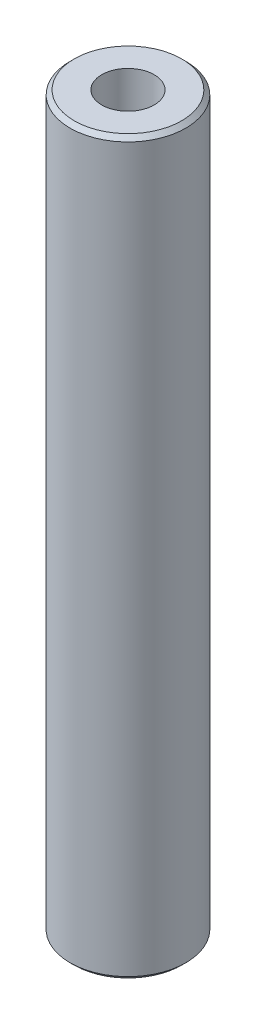
ISO-10303-21;
HEADER;
FILE_DESCRIPTION(('STEP AP214'),'2;1');
FILE_NAME('part.step','',(''),(''),'','','');
FILE_SCHEMA(('AUTOMOTIVE_DESIGN { 1 0 10303 214 1 1 1 1 }'));
ENDSEC;
DATA;
#1=APPLICATION_CONTEXT('core data for automotive mechanical design processes');
#2=APPLICATION_PROTOCOL_DEFINITION('international standard','automotive_design',2000,#1);
#3=PRODUCT_CONTEXT('',#1,'mechanical');
#4=PRODUCT('Part','Part','',(#3));
#5=PRODUCT_RELATED_PRODUCT_CATEGORY('part','',(#4));
#6=PRODUCT_DEFINITION_FORMATION('','',#4);
#7=PRODUCT_DEFINITION_CONTEXT('part definition',#1,'design');
#8=PRODUCT_DEFINITION('design','',#6,#7);
#9=PRODUCT_DEFINITION_SHAPE('','',#8);
#10=(LENGTH_UNIT() NAMED_UNIT(*) SI_UNIT(.MILLI.,.METRE.));
#11=(NAMED_UNIT(*) PLANE_ANGLE_UNIT() SI_UNIT($,.RADIAN.));
#12=(NAMED_UNIT(*) SI_UNIT($,.STERADIAN.) SOLID_ANGLE_UNIT());
#13=UNCERTAINTY_MEASURE_WITH_UNIT(LENGTH_MEASURE(1.E-05),#10,'distance_accuracy_value','');
#14=(GEOMETRIC_REPRESENTATION_CONTEXT(3) GLOBAL_UNCERTAINTY_ASSIGNED_CONTEXT((#13)) GLOBAL_UNIT_ASSIGNED_CONTEXT((#10,
#11,#12)) REPRESENTATION_CONTEXT('',''));
#15=CARTESIAN_POINT('',(0.,0.,0.));
#16=DIRECTION('',(0.,0.,1.));
#17=DIRECTION('',(1.,0.,0.));
#18=AXIS2_PLACEMENT_3D('',#15,#16,#17);
#19=CARTESIAN_POINT('',(0.,600.,0.));
#20=DIRECTION('',(0.,-1.,0.));
#21=DIRECTION('',(0.,0.,-1.));
#22=AXIS2_PLACEMENT_3D('',#19,#20,#21);
#23=CYLINDRICAL_SURFACE('',#22,47.5);
#24=CARTESIAN_POINT('',(0.,596.519227325122,0.));
#25=DIRECTION('',(0.,1.,0.));
#26=DIRECTION('',(0.,0.,1.));
#27=AXIS2_PLACEMENT_3D('',#24,#25,#26);
#28=CIRCLE('',#27,47.5);
#29=CARTESIAN_POINT('',(0.,596.519227325122,47.5));
#30=VERTEX_POINT('',#29);
#31=EDGE_CURVE('E50',#30,#30,#28,.F.);
#32=ORIENTED_EDGE('',*,*,#31,.T.);
#33=EDGE_LOOP('',(#32));
#34=FACE_BOUND('',#33,.T.);
#35=CARTESIAN_POINT('',(0.,3.45241660632234,0.));
#36=DIRECTION('',(0.,1.,0.));
#37=DIRECTION('',(0.,0.,1.));
#38=AXIS2_PLACEMENT_3D('',#35,#36,#37);
#39=CIRCLE('',#38,47.5);
#40=CARTESIAN_POINT('',(0.,3.45241660632234,47.5));
#41=VERTEX_POINT('',#40);
#42=EDGE_CURVE('E51',#41,#41,#39,.T.);
#43=ORIENTED_EDGE('',*,*,#42,.T.);
#44=EDGE_LOOP('',(#43));
#45=FACE_BOUND('',#44,.T.);
#46=ADVANCED_FACE('F39',(#34,#45),#23,.T.);
#47=CARTESIAN_POINT('',(0.,600.,0.));
#48=DIRECTION('',(0.,1.,0.));
#49=DIRECTION('',(0.,0.,1.));
#50=AXIS2_PLACEMENT_3D('',#47,#48,#49);
#51=PLANE('',#50);
#52=CARTESIAN_POINT('',(0.,600.,0.));
#53=DIRECTION('',(0.,1.,0.));
#54=DIRECTION('',(0.,0.,1.));
#55=AXIS2_PLACEMENT_3D('',#52,#53,#54);
#56=CIRCLE('',#55,44.0475833936776);
#57=CARTESIAN_POINT('',(0.,600.,44.0475833936776));
#58=VERTEX_POINT('',#57);
#59=EDGE_CURVE('E54',#58,#58,#56,.T.);
#60=ORIENTED_EDGE('',*,*,#59,.T.);
#61=EDGE_LOOP('',(#60));
#62=FACE_BOUND('',#61,.T.);
#63=CARTESIAN_POINT('',(0.,600.,0.));
#64=DIRECTION('',(0.,1.,0.));
#65=DIRECTION('',(0.,0.,1.));
#66=AXIS2_PLACEMENT_3D('',#63,#64,#65);
#67=CIRCLE('',#66,21.5306994668551);
#68=CARTESIAN_POINT('',(0.,600.,21.5306994668551));
#69=VERTEX_POINT('',#68);
#70=EDGE_CURVE('E58',#69,#69,#67,.T.);
#71=ORIENTED_EDGE('',*,*,#70,.F.);
#72=EDGE_LOOP('',(#71));
#73=FACE_BOUND('',#72,.T.);
#74=ADVANCED_FACE('F69',(#62,#73),#51,.T.);
#75=CARTESIAN_POINT('',(0.,0.,0.));
#76=DIRECTION('',(0.,1.,0.));
#77=DIRECTION('',(0.,0.,1.));
#78=AXIS2_PLACEMENT_3D('',#75,#76,#77);
#79=PLANE('',#78);
#80=CARTESIAN_POINT('',(0.,0.,0.));
#81=DIRECTION('',(0.,1.,0.));
#82=DIRECTION('',(0.,0.,1.));
#83=AXIS2_PLACEMENT_3D('',#80,#81,#82);
#84=CIRCLE('',#83,44.0192273251221);
#85=CARTESIAN_POINT('',(0.,0.,44.0192273251221));
#86=VERTEX_POINT('',#85);
#87=EDGE_CURVE('E10',#86,#86,#84,.F.);
#88=ORIENTED_EDGE('',*,*,#87,.T.);
#89=EDGE_LOOP('',(#88));
#90=FACE_BOUND('',#89,.T.);
#91=CARTESIAN_POINT('',(0.,0.,0.));
#92=DIRECTION('',(0.,1.,0.));
#93=DIRECTION('',(0.,0.,1.));
#94=AXIS2_PLACEMENT_3D('',#91,#92,#93);
#95=CIRCLE('',#94,21.5306994668551);
#96=CARTESIAN_POINT('',(0.,0.,21.5306994668551));
#97=VERTEX_POINT('',#96);
#98=EDGE_CURVE('E63',#97,#97,#95,.T.);
#99=ORIENTED_EDGE('',*,*,#98,.T.);
#100=EDGE_LOOP('',(#99));
#101=FACE_BOUND('',#100,.T.);
#102=ADVANCED_FACE('F75',(#90,#101),#79,.F.);
#103=CARTESIAN_POINT('',(0.,600.,0.));
#104=DIRECTION('',(0.,-1.,0.));
#105=DIRECTION('',(0.,0.,-1.));
#106=AXIS2_PLACEMENT_3D('',#103,#104,#105);
#107=CYLINDRICAL_SURFACE('',#106,21.5306994668551);
#108=ORIENTED_EDGE('',*,*,#70,.T.);
#109=EDGE_LOOP('',(#108));
#110=FACE_BOUND('',#109,.T.);
#111=ORIENTED_EDGE('',*,*,#98,.F.);
#112=EDGE_LOOP('',(#111));
#113=FACE_BOUND('',#112,.T.);
#114=ADVANCED_FACE('F70',(#110,#113),#107,.F.);
#115=CARTESIAN_POINT('',(0.,600.,0.));
#116=DIRECTION('',(0.,-1.,0.));
#117=DIRECTION('',(0.,0.,-1.));
#118=AXIS2_PLACEMENT_3D('',#115,#116,#117);
#119=CONICAL_SURFACE('',#118,44.0475833936776,0.781308283646573);
#120=ORIENTED_EDGE('',*,*,#31,.F.);
#121=EDGE_LOOP('',(#120));
#122=FACE_BOUND('',#121,.T.);
#123=ORIENTED_EDGE('',*,*,#59,.F.);
#124=EDGE_LOOP('',(#123));
#125=FACE_BOUND('',#124,.T.);
#126=ADVANCED_FACE('F81',(#122,#125),#119,.T.);
#127=CARTESIAN_POINT('',(0.,3.45241660632234,0.));
#128=DIRECTION('',(0.,1.,0.));
#129=DIRECTION('',(0.,0.,1.));
#130=AXIS2_PLACEMENT_3D('',#127,#128,#129);
#131=CONICAL_SURFACE('',#130,47.5,0.789488043148346);
#132=ORIENTED_EDGE('',*,*,#87,.F.);
#133=EDGE_LOOP('',(#132));
#134=FACE_BOUND('',#133,.T.);
#135=ORIENTED_EDGE('',*,*,#42,.F.);
#136=EDGE_LOOP('',(#135));
#137=FACE_BOUND('',#136,.T.);
#138=ADVANCED_FACE('F45',(#134,#137),#131,.T.);
#139=CLOSED_SHELL('',(#46,#74,#102,#114,#126,#138));
#140=MANIFOLD_SOLID_BREP('B2',#139);
#141=ADVANCED_BREP_SHAPE_REPRESENTATION('',(#18,#140),#14);
#142=SHAPE_DEFINITION_REPRESENTATION(#9,#141);
ENDSEC;
END-ISO-10303-21;
